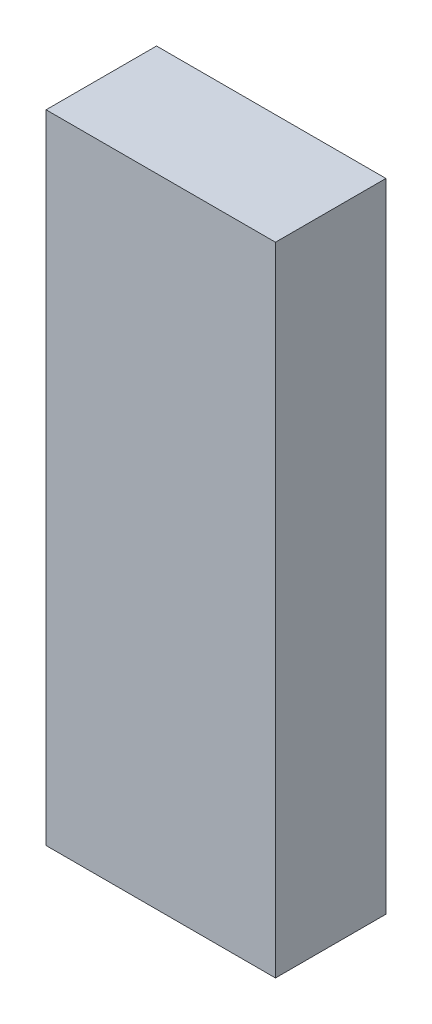
ISO-10303-21;
HEADER;
FILE_DESCRIPTION(('STEP AP214'),'2;1');
FILE_NAME('part.step','',(''),(''),'','','');
FILE_SCHEMA(('AUTOMOTIVE_DESIGN { 1 0 10303 214 1 1 1 1 }'));
ENDSEC;
DATA;
#1=APPLICATION_CONTEXT('core data for automotive mechanical design processes');
#2=APPLICATION_PROTOCOL_DEFINITION('international standard','automotive_design',2000,#1);
#3=PRODUCT_CONTEXT('',#1,'mechanical');
#4=PRODUCT('Part','Part','',(#3));
#5=PRODUCT_RELATED_PRODUCT_CATEGORY('part','',(#4));
#6=PRODUCT_DEFINITION_FORMATION('','',#4);
#7=PRODUCT_DEFINITION_CONTEXT('part definition',#1,'design');
#8=PRODUCT_DEFINITION('design','',#6,#7);
#9=PRODUCT_DEFINITION_SHAPE('','',#8);
#10=(LENGTH_UNIT() NAMED_UNIT(*) SI_UNIT(.MILLI.,.METRE.));
#11=(NAMED_UNIT(*) PLANE_ANGLE_UNIT() SI_UNIT($,.RADIAN.));
#12=(NAMED_UNIT(*) SI_UNIT($,.STERADIAN.) SOLID_ANGLE_UNIT());
#13=UNCERTAINTY_MEASURE_WITH_UNIT(LENGTH_MEASURE(1.E-05),#10,'distance_accuracy_value','');
#14=(GEOMETRIC_REPRESENTATION_CONTEXT(3) GLOBAL_UNCERTAINTY_ASSIGNED_CONTEXT((#13)) GLOBAL_UNIT_ASSIGNED_CONTEXT((#10,
#11,#12)) REPRESENTATION_CONTEXT('',''));
#15=CARTESIAN_POINT('',(0.,0.,0.));
#16=DIRECTION('',(0.,0.,1.));
#17=DIRECTION('',(1.,0.,0.));
#18=AXIS2_PLACEMENT_3D('',#15,#16,#17);
#19=CARTESIAN_POINT('',(0.,75.,0.));
#20=DIRECTION('',(1.,0.,0.));
#21=DIRECTION('',(0.,0.,-1.));
#22=AXIS2_PLACEMENT_3D('',#19,#20,#21);
#23=PLANE('',#22);
#24=DIRECTION('',(0.,0.,1.));
#25=VECTOR('',#24,1.);
#26=CARTESIAN_POINT('',(0.,0.,0.));
#27=LINE('',#26,#25);
#28=CARTESIAN_POINT('',(0.,0.,-13.));
#29=VERTEX_POINT('',#28);
#30=CARTESIAN_POINT('',(0.,0.,0.));
#31=VERTEX_POINT('',#30);
#32=EDGE_CURVE('E96',#29,#31,#27,.T.);
#33=ORIENTED_EDGE('',*,*,#32,.T.);
#34=DIRECTION('',(0.,-1.,0.));
#35=VECTOR('',#34,1.);
#36=CARTESIAN_POINT('',(0.,75.,0.));
#37=LINE('',#36,#35);
#38=CARTESIAN_POINT('',(0.,75.,0.));
#39=VERTEX_POINT('',#38);
#40=EDGE_CURVE('E11',#39,#31,#37,.T.);
#41=ORIENTED_EDGE('',*,*,#40,.F.);
#42=DIRECTION('',(0.,0.,1.));
#43=VECTOR('',#42,1.);
#44=CARTESIAN_POINT('',(0.,75.,0.));
#45=LINE('',#44,#43);
#46=CARTESIAN_POINT('',(0.,75.,-13.));
#47=VERTEX_POINT('',#46);
#48=EDGE_CURVE('E84',#47,#39,#45,.T.);
#49=ORIENTED_EDGE('',*,*,#48,.F.);
#50=DIRECTION('',(0.,-1.,0.));
#51=VECTOR('',#50,1.);
#52=CARTESIAN_POINT('',(0.,75.,-13.));
#53=LINE('',#52,#51);
#54=EDGE_CURVE('E92',#47,#29,#53,.T.);
#55=ORIENTED_EDGE('',*,*,#54,.T.);
#56=EDGE_LOOP('',(#33,#41,#49,#55));
#57=FACE_BOUND('',#56,.T.);
#58=ADVANCED_FACE('F33',(#57),#23,.F.);
#59=CARTESIAN_POINT('',(0.,75.,0.));
#60=DIRECTION('',(0.,0.,-1.));
#61=DIRECTION('',(-1.,0.,0.));
#62=AXIS2_PLACEMENT_3D('',#59,#60,#61);
#63=PLANE('',#62);
#64=DIRECTION('',(1.,0.,0.));
#65=VECTOR('',#64,1.);
#66=CARTESIAN_POINT('',(0.,0.,0.));
#67=LINE('',#66,#65);
#68=CARTESIAN_POINT('',(27.,0.,0.));
#69=VERTEX_POINT('',#68);
#70=EDGE_CURVE('E88',#31,#69,#67,.T.);
#71=ORIENTED_EDGE('',*,*,#70,.T.);
#72=DIRECTION('',(0.,-1.,0.));
#73=VECTOR('',#72,1.);
#74=CARTESIAN_POINT('',(27.,75.,0.));
#75=LINE('',#74,#73);
#76=CARTESIAN_POINT('',(27.,75.,0.));
#77=VERTEX_POINT('',#76);
#78=EDGE_CURVE('E41',#77,#69,#75,.T.);
#79=ORIENTED_EDGE('',*,*,#78,.F.);
#80=DIRECTION('',(1.,0.,0.));
#81=VECTOR('',#80,1.);
#82=CARTESIAN_POINT('',(0.,75.,0.));
#83=LINE('',#82,#81);
#84=EDGE_CURVE('E79',#39,#77,#83,.T.);
#85=ORIENTED_EDGE('',*,*,#84,.F.);
#86=ORIENTED_EDGE('',*,*,#40,.T.);
#87=EDGE_LOOP('',(#71,#79,#85,#86));
#88=FACE_BOUND('',#87,.T.);
#89=ADVANCED_FACE('F87',(#88),#63,.F.);
#90=CARTESIAN_POINT('',(27.,75.,0.));
#91=DIRECTION('',(-1.,0.,0.));
#92=DIRECTION('',(0.,0.,1.));
#93=AXIS2_PLACEMENT_3D('',#90,#91,#92);
#94=PLANE('',#93);
#95=DIRECTION('',(0.,0.,-1.));
#96=VECTOR('',#95,1.);
#97=CARTESIAN_POINT('',(27.,0.,0.));
#98=LINE('',#97,#96);
#99=CARTESIAN_POINT('',(27.,0.,-13.));
#100=VERTEX_POINT('',#99);
#101=EDGE_CURVE('E66',#69,#100,#98,.T.);
#102=ORIENTED_EDGE('',*,*,#101,.T.);
#103=DIRECTION('',(0.,-1.,0.));
#104=VECTOR('',#103,1.);
#105=CARTESIAN_POINT('',(27.,75.,-13.));
#106=LINE('',#105,#104);
#107=CARTESIAN_POINT('',(27.,75.,-13.));
#108=VERTEX_POINT('',#107);
#109=EDGE_CURVE('E89',#108,#100,#106,.T.);
#110=ORIENTED_EDGE('',*,*,#109,.F.);
#111=DIRECTION('',(0.,0.,-1.));
#112=VECTOR('',#111,1.);
#113=CARTESIAN_POINT('',(27.,75.,0.));
#114=LINE('',#113,#112);
#115=EDGE_CURVE('E82',#77,#108,#114,.T.);
#116=ORIENTED_EDGE('',*,*,#115,.F.);
#117=ORIENTED_EDGE('',*,*,#78,.T.);
#118=EDGE_LOOP('',(#102,#110,#116,#117));
#119=FACE_BOUND('',#118,.T.);
#120=ADVANCED_FACE('F90',(#119),#94,.F.);
#121=CARTESIAN_POINT('',(0.,75.,-13.));
#122=DIRECTION('',(0.,0.,1.));
#123=DIRECTION('',(1.,0.,0.));
#124=AXIS2_PLACEMENT_3D('',#121,#122,#123);
#125=PLANE('',#124);
#126=DIRECTION('',(-1.,0.,0.));
#127=VECTOR('',#126,1.);
#128=CARTESIAN_POINT('',(0.,0.,-13.));
#129=LINE('',#128,#127);
#130=EDGE_CURVE('E72',#100,#29,#129,.T.);
#131=ORIENTED_EDGE('',*,*,#130,.T.);
#132=ORIENTED_EDGE('',*,*,#54,.F.);
#133=DIRECTION('',(-1.,0.,0.));
#134=VECTOR('',#133,1.);
#135=CARTESIAN_POINT('',(0.,75.,-13.));
#136=LINE('',#135,#134);
#137=EDGE_CURVE('E49',#108,#47,#136,.T.);
#138=ORIENTED_EDGE('',*,*,#137,.F.);
#139=ORIENTED_EDGE('',*,*,#109,.T.);
#140=EDGE_LOOP('',(#131,#132,#138,#139));
#141=FACE_BOUND('',#140,.T.);
#142=ADVANCED_FACE('F103',(#141),#125,.F.);
#143=CARTESIAN_POINT('',(0.,75.,0.));
#144=DIRECTION('',(0.,-1.,0.));
#145=DIRECTION('',(0.,0.,-1.));
#146=AXIS2_PLACEMENT_3D('',#143,#144,#145);
#147=PLANE('',#146);
#148=ORIENTED_EDGE('',*,*,#48,.T.);
#149=ORIENTED_EDGE('',*,*,#84,.T.);
#150=ORIENTED_EDGE('',*,*,#115,.T.);
#151=ORIENTED_EDGE('',*,*,#137,.T.);
#152=EDGE_LOOP('',(#148,#149,#150,#151));
#153=FACE_BOUND('',#152,.T.);
#154=ADVANCED_FACE('F80',(#153),#147,.F.);
#155=CARTESIAN_POINT('',(0.,0.,0.));
#156=DIRECTION('',(0.,-1.,0.));
#157=DIRECTION('',(0.,0.,-1.));
#158=AXIS2_PLACEMENT_3D('',#155,#156,#157);
#159=PLANE('',#158);
#160=ORIENTED_EDGE('',*,*,#32,.F.);
#161=ORIENTED_EDGE('',*,*,#130,.F.);
#162=ORIENTED_EDGE('',*,*,#101,.F.);
#163=ORIENTED_EDGE('',*,*,#70,.F.);
#164=EDGE_LOOP('',(#160,#161,#162,#163));
#165=FACE_BOUND('',#164,.T.);
#166=ADVANCED_FACE('F106',(#165),#159,.T.);
#167=CLOSED_SHELL('',(#58,#89,#120,#142,#154,#166));
#168=MANIFOLD_SOLID_BREP('B2',#167);
#169=ADVANCED_BREP_SHAPE_REPRESENTATION('',(#18,#168),#14);
#170=SHAPE_DEFINITION_REPRESENTATION(#9,#169);
ENDSEC;
END-ISO-10303-21;
